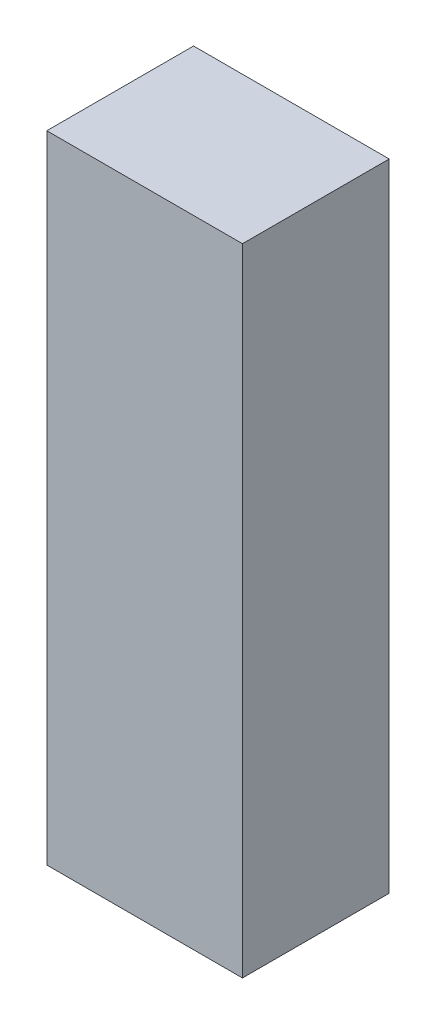
ISO-10303-21;
HEADER;
FILE_DESCRIPTION(('STEP AP214'),'2;1');
FILE_NAME('part.step','',(''),(''),'','','');
FILE_SCHEMA(('AUTOMOTIVE_DESIGN { 1 0 10303 214 1 1 1 1 }'));
ENDSEC;
DATA;
#1=APPLICATION_CONTEXT('core data for automotive mechanical design processes');
#2=APPLICATION_PROTOCOL_DEFINITION('international standard','automotive_design',2000,#1);
#3=PRODUCT_CONTEXT('',#1,'mechanical');
#4=PRODUCT('Part','Part','',(#3));
#5=PRODUCT_RELATED_PRODUCT_CATEGORY('part','',(#4));
#6=PRODUCT_DEFINITION_FORMATION('','',#4);
#7=PRODUCT_DEFINITION_CONTEXT('part definition',#1,'design');
#8=PRODUCT_DEFINITION('design','',#6,#7);
#9=PRODUCT_DEFINITION_SHAPE('','',#8);
#10=(LENGTH_UNIT() NAMED_UNIT(*) SI_UNIT(.MILLI.,.METRE.));
#11=(NAMED_UNIT(*) PLANE_ANGLE_UNIT() SI_UNIT($,.RADIAN.));
#12=(NAMED_UNIT(*) SI_UNIT($,.STERADIAN.) SOLID_ANGLE_UNIT());
#13=UNCERTAINTY_MEASURE_WITH_UNIT(LENGTH_MEASURE(1.E-05),#10,'distance_accuracy_value','');
#14=(GEOMETRIC_REPRESENTATION_CONTEXT(3) GLOBAL_UNCERTAINTY_ASSIGNED_CONTEXT((#13)) GLOBAL_UNIT_ASSIGNED_CONTEXT((#10,
#11,#12)) REPRESENTATION_CONTEXT('',''));
#15=CARTESIAN_POINT('',(0.,0.,0.));
#16=DIRECTION('',(0.,0.,1.));
#17=DIRECTION('',(1.,0.,0.));
#18=AXIS2_PLACEMENT_3D('',#15,#16,#17);
#19=CARTESIAN_POINT('',(-0.1999996,0.65000124,0.3));
#20=DIRECTION('',(0.,0.,1.));
#21=DIRECTION('',(1.,0.,0.));
#22=AXIS2_PLACEMENT_3D('',#19,#20,#21);
#23=PLANE('',#22);
#24=DIRECTION('',(0.,1.,0.));
#25=VECTOR('',#24,1.);
#26=CARTESIAN_POINT('',(0.20000214,0.65000124,0.3));
#27=LINE('',#26,#25);
#28=CARTESIAN_POINT('',(0.20000214,0.65000124,0.3));
#29=VERTEX_POINT('',#28);
#30=CARTESIAN_POINT('',(0.20000214,-0.6499987,0.3));
#31=VERTEX_POINT('',#30);
#32=EDGE_CURVE('E52',#29,#31,#27,.F.);
#33=ORIENTED_EDGE('',*,*,#32,.F.);
#34=DIRECTION('',(1.,0.,0.));
#35=VECTOR('',#34,1.);
#36=CARTESIAN_POINT('',(-0.1999996,0.65000124,0.3));
#37=LINE('',#36,#35);
#38=CARTESIAN_POINT('',(-0.1999996,0.65000124,0.3));
#39=VERTEX_POINT('',#38);
#40=EDGE_CURVE('E67',#39,#29,#37,.T.);
#41=ORIENTED_EDGE('',*,*,#40,.F.);
#42=DIRECTION('',(0.,1.,0.));
#43=VECTOR('',#42,1.);
#44=CARTESIAN_POINT('',(-0.1999996,-0.6499987,0.3));
#45=LINE('',#44,#43);
#46=CARTESIAN_POINT('',(-0.1999996,-0.6499987,0.3));
#47=VERTEX_POINT('',#46);
#48=EDGE_CURVE('E19',#47,#39,#45,.T.);
#49=ORIENTED_EDGE('',*,*,#48,.F.);
#50=DIRECTION('',(1.,0.,0.));
#51=VECTOR('',#50,1.);
#52=CARTESIAN_POINT('',(0.20000214,-0.6499987,0.3));
#53=LINE('',#52,#51);
#54=EDGE_CURVE('E57',#31,#47,#53,.F.);
#55=ORIENTED_EDGE('',*,*,#54,.F.);
#56=EDGE_LOOP('',(#33,#41,#49,#55));
#57=FACE_BOUND('',#56,.T.);
#58=ADVANCED_FACE('F16',(#57),#23,.T.);
#59=CARTESIAN_POINT('',(-0.1999996,-0.6499987,0.));
#60=DIRECTION('',(-1.,0.,0.));
#61=DIRECTION('',(0.,0.,1.));
#62=AXIS2_PLACEMENT_3D('',#59,#60,#61);
#63=PLANE('',#62);
#64=DIRECTION('',(0.,0.,1.));
#65=VECTOR('',#64,1.);
#66=CARTESIAN_POINT('',(-0.1999996,0.65000124,0.));
#67=LINE('',#66,#65);
#68=CARTESIAN_POINT('',(-0.1999996,0.65000124,0.));
#69=VERTEX_POINT('',#68);
#70=EDGE_CURVE('E78',#69,#39,#67,.T.);
#71=ORIENTED_EDGE('',*,*,#70,.F.);
#72=DIRECTION('',(0.,1.,0.));
#73=VECTOR('',#72,1.);
#74=CARTESIAN_POINT('',(-0.1999996,0.65000124,0.));
#75=LINE('',#74,#73);
#76=CARTESIAN_POINT('',(-0.1999996,-0.6499987,0.));
#77=VERTEX_POINT('',#76);
#78=EDGE_CURVE('E73',#69,#77,#75,.F.);
#79=ORIENTED_EDGE('',*,*,#78,.T.);
#80=DIRECTION('',(0.,0.,-1.));
#81=VECTOR('',#80,1.);
#82=CARTESIAN_POINT('',(-0.1999996,-0.6499987,0.));
#83=LINE('',#82,#81);
#84=EDGE_CURVE('E62',#47,#77,#83,.T.);
#85=ORIENTED_EDGE('',*,*,#84,.F.);
#86=ORIENTED_EDGE('',*,*,#48,.T.);
#87=EDGE_LOOP('',(#71,#79,#85,#86));
#88=FACE_BOUND('',#87,.T.);
#89=ADVANCED_FACE('F72',(#88),#63,.T.);
#90=CARTESIAN_POINT('',(0.20000214,-0.6499987,0.));
#91=DIRECTION('',(0.,-1.,0.));
#92=DIRECTION('',(0.,0.,-1.));
#93=AXIS2_PLACEMENT_3D('',#90,#91,#92);
#94=PLANE('',#93);
#95=ORIENTED_EDGE('',*,*,#84,.T.);
#96=DIRECTION('',(1.,0.,0.));
#97=VECTOR('',#96,1.);
#98=CARTESIAN_POINT('',(-0.1999996,-0.6499987,0.));
#99=LINE('',#98,#97);
#100=CARTESIAN_POINT('',(0.20000214,-0.6499987,0.));
#101=VERTEX_POINT('',#100);
#102=EDGE_CURVE('E83',#77,#101,#99,.T.);
#103=ORIENTED_EDGE('',*,*,#102,.T.);
#104=DIRECTION('',(0.,0.,-1.));
#105=VECTOR('',#104,1.);
#106=CARTESIAN_POINT('',(0.20000214,-0.6499987,0.));
#107=LINE('',#106,#105);
#108=EDGE_CURVE('E64',#31,#101,#107,.T.);
#109=ORIENTED_EDGE('',*,*,#108,.F.);
#110=ORIENTED_EDGE('',*,*,#54,.T.);
#111=EDGE_LOOP('',(#95,#103,#109,#110));
#112=FACE_BOUND('',#111,.T.);
#113=ADVANCED_FACE('F59',(#112),#94,.T.);
#114=CARTESIAN_POINT('',(0.20000214,0.65000124,0.));
#115=DIRECTION('',(1.,0.,0.));
#116=DIRECTION('',(0.,0.,-1.));
#117=AXIS2_PLACEMENT_3D('',#114,#115,#116);
#118=PLANE('',#117);
#119=ORIENTED_EDGE('',*,*,#108,.T.);
#120=DIRECTION('',(0.,1.,0.));
#121=VECTOR('',#120,1.);
#122=CARTESIAN_POINT('',(0.20000214,0.65000124,0.));
#123=LINE('',#122,#121);
#124=CARTESIAN_POINT('',(0.20000214,0.65000124,0.));
#125=VERTEX_POINT('',#124);
#126=EDGE_CURVE('E25',#101,#125,#123,.T.);
#127=ORIENTED_EDGE('',*,*,#126,.T.);
#128=DIRECTION('',(0.,0.,1.));
#129=VECTOR('',#128,1.);
#130=CARTESIAN_POINT('',(0.20000214,0.65000124,0.));
#131=LINE('',#130,#129);
#132=EDGE_CURVE('E33',#29,#125,#131,.F.);
#133=ORIENTED_EDGE('',*,*,#132,.F.);
#134=ORIENTED_EDGE('',*,*,#32,.T.);
#135=EDGE_LOOP('',(#119,#127,#133,#134));
#136=FACE_BOUND('',#135,.T.);
#137=ADVANCED_FACE('F87',(#136),#118,.T.);
#138=CARTESIAN_POINT('',(-0.1999996,0.65000124,0.));
#139=DIRECTION('',(0.,1.,0.));
#140=DIRECTION('',(0.,0.,1.));
#141=AXIS2_PLACEMENT_3D('',#138,#139,#140);
#142=PLANE('',#141);
#143=ORIENTED_EDGE('',*,*,#132,.T.);
#144=DIRECTION('',(1.,0.,0.));
#145=VECTOR('',#144,1.);
#146=CARTESIAN_POINT('',(-0.1999996,0.65000124,0.));
#147=LINE('',#146,#145);
#148=EDGE_CURVE('E11',#125,#69,#147,.F.);
#149=ORIENTED_EDGE('',*,*,#148,.T.);
#150=ORIENTED_EDGE('',*,*,#70,.T.);
#151=ORIENTED_EDGE('',*,*,#40,.T.);
#152=EDGE_LOOP('',(#143,#149,#150,#151));
#153=FACE_BOUND('',#152,.T.);
#154=ADVANCED_FACE('F90',(#153),#142,.T.);
#155=CARTESIAN_POINT('',(-0.1999996,0.65000124,0.));
#156=DIRECTION('',(0.,0.,1.));
#157=DIRECTION('',(1.,0.,0.));
#158=AXIS2_PLACEMENT_3D('',#155,#156,#157);
#159=PLANE('',#158);
#160=ORIENTED_EDGE('',*,*,#126,.F.);
#161=ORIENTED_EDGE('',*,*,#102,.F.);
#162=ORIENTED_EDGE('',*,*,#78,.F.);
#163=ORIENTED_EDGE('',*,*,#148,.F.);
#164=EDGE_LOOP('',(#160,#161,#162,#163));
#165=FACE_BOUND('',#164,.T.);
#166=ADVANCED_FACE('F89',(#165),#159,.F.);
#167=CLOSED_SHELL('',(#58,#89,#113,#137,#154,#166));
#168=MANIFOLD_SOLID_BREP('B1',#167);
#169=ADVANCED_BREP_SHAPE_REPRESENTATION('',(#18,#168),#14);
#170=SHAPE_DEFINITION_REPRESENTATION(#9,#169);
ENDSEC;
END-ISO-10303-21;
